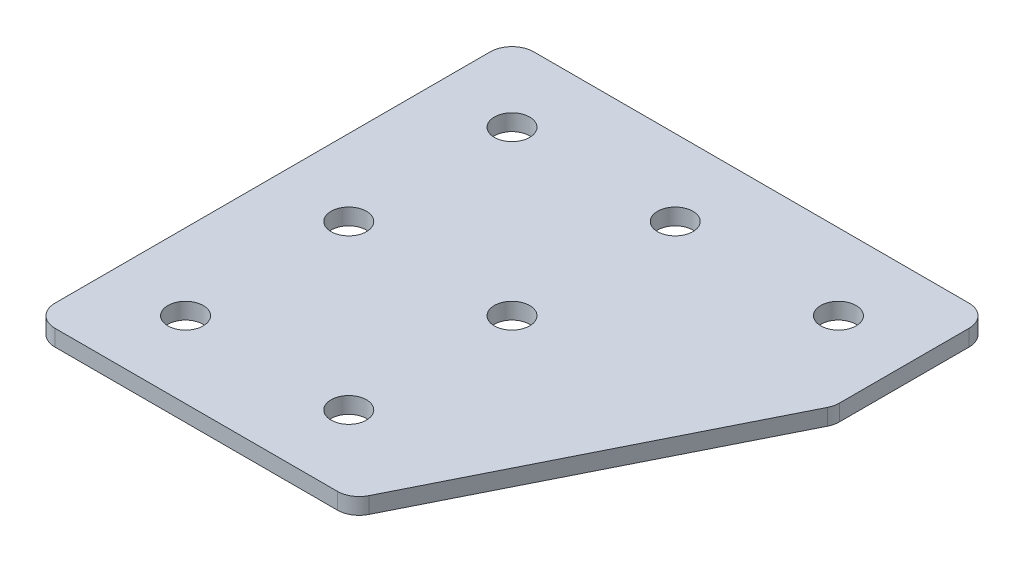
ISO-10303-21;
HEADER;
FILE_DESCRIPTION(('STEP AP214'),'2;1');
FILE_NAME('part.step','',(''),(''),'','','');
FILE_SCHEMA(('AUTOMOTIVE_DESIGN { 1 0 10303 214 1 1 1 1 }'));
ENDSEC;
DATA;
#1=APPLICATION_CONTEXT('core data for automotive mechanical design processes');
#2=APPLICATION_PROTOCOL_DEFINITION('international standard','automotive_design',2000,#1);
#3=PRODUCT_CONTEXT('',#1,'mechanical');
#4=PRODUCT('Part','Part','',(#3));
#5=PRODUCT_RELATED_PRODUCT_CATEGORY('part','',(#4));
#6=PRODUCT_DEFINITION_FORMATION('','',#4);
#7=PRODUCT_DEFINITION_CONTEXT('part definition',#1,'design');
#8=PRODUCT_DEFINITION('design','',#6,#7);
#9=PRODUCT_DEFINITION_SHAPE('','',#8);
#10=(LENGTH_UNIT() NAMED_UNIT(*) SI_UNIT(.MILLI.,.METRE.));
#11=(NAMED_UNIT(*) PLANE_ANGLE_UNIT() SI_UNIT($,.RADIAN.));
#12=(NAMED_UNIT(*) SI_UNIT($,.STERADIAN.) SOLID_ANGLE_UNIT());
#13=UNCERTAINTY_MEASURE_WITH_UNIT(LENGTH_MEASURE(1.E-05),#10,'distance_accuracy_value','');
#14=(GEOMETRIC_REPRESENTATION_CONTEXT(3) GLOBAL_UNCERTAINTY_ASSIGNED_CONTEXT((#13)) GLOBAL_UNIT_ASSIGNED_CONTEXT((#10,
#11,#12)) REPRESENTATION_CONTEXT('',''));
#15=CARTESIAN_POINT('',(0.,0.,0.));
#16=DIRECTION('',(0.,0.,1.));
#17=DIRECTION('',(1.,0.,0.));
#18=AXIS2_PLACEMENT_3D('',#15,#16,#17);
#19=CARTESIAN_POINT('',(-9.06181460766891,2.17462627726309,-16.3623363744272));
#20=DIRECTION('',(0.,-1.,0.));
#21=DIRECTION('',(0.,0.,-1.));
#22=AXIS2_PLACEMENT_3D('',#19,#20,#21);
#23=PLANE('',#22);
#24=CARTESIAN_POINT('',(-1.5618146076689,2.17462627726309,13.6376636255728));
#25=DIRECTION('',(0.,1.,0.));
#26=DIRECTION('',(0.,0.,1.));
#27=AXIS2_PLACEMENT_3D('',#24,#25,#26);
#28=CIRCLE('',#27,1.625);
#29=CARTESIAN_POINT('',(-1.5618146076689,2.17462627726309,15.2626636255728));
#30=VERTEX_POINT('',#29);
#31=EDGE_CURVE('E257',#30,#30,#28,.T.);
#32=ORIENTED_EDGE('',*,*,#31,.T.);
#33=EDGE_LOOP('',(#32));
#34=FACE_BOUND('',#33,.T.);
#35=CARTESIAN_POINT('',(-16.5618146076689,2.17462627726309,13.6376636255728));
#36=DIRECTION('',(0.,1.,0.));
#37=DIRECTION('',(0.,0.,1.));
#38=AXIS2_PLACEMENT_3D('',#35,#36,#37);
#39=CIRCLE('',#38,1.625);
#40=CARTESIAN_POINT('',(-16.5618146076689,2.17462627726309,15.2626636255728));
#41=VERTEX_POINT('',#40);
#42=EDGE_CURVE('E265',#41,#41,#39,.T.);
#43=ORIENTED_EDGE('',*,*,#42,.T.);
#44=EDGE_LOOP('',(#43));
#45=FACE_BOUND('',#44,.T.);
#46=CARTESIAN_POINT('',(-1.5618146076689,2.17462627726309,-1.36233637442725));
#47=DIRECTION('',(0.,1.,0.));
#48=DIRECTION('',(0.,0.,1.));
#49=AXIS2_PLACEMENT_3D('',#46,#47,#48);
#50=CIRCLE('',#49,1.625);
#51=CARTESIAN_POINT('',(-1.5618146076689,2.17462627726309,0.262663625572754));
#52=VERTEX_POINT('',#51);
#53=EDGE_CURVE('E271',#52,#52,#50,.T.);
#54=ORIENTED_EDGE('',*,*,#53,.T.);
#55=EDGE_LOOP('',(#54));
#56=FACE_BOUND('',#55,.T.);
#57=CARTESIAN_POINT('',(-16.5618146076689,2.17462627726309,-1.36233637442725));
#58=DIRECTION('',(0.,1.,0.));
#59=DIRECTION('',(0.,0.,1.));
#60=AXIS2_PLACEMENT_3D('',#57,#58,#59);
#61=CIRCLE('',#60,1.625);
#62=CARTESIAN_POINT('',(-16.5618146076689,2.17462627726309,0.262663625572754));
#63=VERTEX_POINT('',#62);
#64=EDGE_CURVE('E277',#63,#63,#61,.T.);
#65=ORIENTED_EDGE('',*,*,#64,.T.);
#66=EDGE_LOOP('',(#65));
#67=FACE_BOUND('',#66,.T.);
#68=CARTESIAN_POINT('',(13.4381853923311,2.17462627726309,-16.3623363744272));
#69=DIRECTION('',(0.,1.,0.));
#70=DIRECTION('',(0.,0.,1.));
#71=AXIS2_PLACEMENT_3D('',#68,#69,#70);
#72=CIRCLE('',#71,1.625);
#73=CARTESIAN_POINT('',(13.4381853923311,2.17462627726309,-14.7373363744272));
#74=VERTEX_POINT('',#73);
#75=EDGE_CURVE('E283',#74,#74,#72,.T.);
#76=ORIENTED_EDGE('',*,*,#75,.T.);
#77=EDGE_LOOP('',(#76));
#78=FACE_BOUND('',#77,.T.);
#79=CARTESIAN_POINT('',(-1.5618146076689,2.17462627726309,-16.3623363744272));
#80=DIRECTION('',(0.,1.,0.));
#81=DIRECTION('',(0.,0.,1.));
#82=AXIS2_PLACEMENT_3D('',#79,#80,#81);
#83=CIRCLE('',#82,1.625);
#84=CARTESIAN_POINT('',(-1.5618146076689,2.17462627726309,-14.7373363744272));
#85=VERTEX_POINT('',#84);
#86=EDGE_CURVE('E289',#85,#85,#83,.T.);
#87=ORIENTED_EDGE('',*,*,#86,.T.);
#88=EDGE_LOOP('',(#87));
#89=FACE_BOUND('',#88,.T.);
#90=CARTESIAN_POINT('',(-16.5618146076689,2.17462627726309,-16.3623363744272));
#91=DIRECTION('',(0.,1.,0.));
#92=DIRECTION('',(0.,0.,1.));
#93=AXIS2_PLACEMENT_3D('',#90,#91,#92);
#94=CIRCLE('',#93,1.625);
#95=CARTESIAN_POINT('',(-16.5618146076689,2.17462627726309,-14.7373363744272));
#96=VERTEX_POINT('',#95);
#97=EDGE_CURVE('E176',#96,#96,#94,.T.);
#98=ORIENTED_EDGE('',*,*,#97,.T.);
#99=EDGE_LOOP('',(#98));
#100=FACE_BOUND('',#99,.T.);
#101=DIRECTION('',(1.,0.,0.));
#102=VECTOR('',#101,1.);
#103=CARTESIAN_POINT('',(-23.561814607669,2.17462627726309,20.6376636255727));
#104=LINE('',#103,#102);
#105=CARTESIAN_POINT('',(-21.561814607669,2.17462627726309,20.6376636255727));
#106=VERTEX_POINT('',#105);
#107=CARTESIAN_POINT('',(4.39310042045646,2.17462627726309,20.6376636255727));
#108=VERTEX_POINT('',#107);
#109=EDGE_CURVE('E165',#106,#108,#104,.T.);
#110=ORIENTED_EDGE('',*,*,#109,.F.);
#111=CARTESIAN_POINT('',(-21.561814607669,2.17462627726309,18.6376636255727));
#112=DIRECTION('',(0.,-1.,0.));
#113=DIRECTION('',(0.,0.,-1.));
#114=AXIS2_PLACEMENT_3D('',#111,#112,#113);
#115=CIRCLE('',#114,2.);
#116=CARTESIAN_POINT('',(-23.561814607669,2.17462627726309,18.6376636255727));
#117=VERTEX_POINT('',#116);
#118=EDGE_CURVE('E146',#106,#117,#115,.T.);
#119=ORIENTED_EDGE('',*,*,#118,.T.);
#120=DIRECTION('',(0.,0.,1.));
#121=VECTOR('',#120,1.);
#122=CARTESIAN_POINT('',(-23.561814607669,2.17462627726309,-23.3623363744273));
#123=LINE('',#122,#121);
#124=CARTESIAN_POINT('',(-23.561814607669,2.17462627726309,-21.3623363744273));
#125=VERTEX_POINT('',#124);
#126=EDGE_CURVE('E163',#125,#117,#123,.T.);
#127=ORIENTED_EDGE('',*,*,#126,.F.);
#128=CARTESIAN_POINT('',(-21.561814607669,2.17462627726309,-21.3623363744273));
#129=DIRECTION('',(0.,-1.,0.));
#130=DIRECTION('',(0.,0.,-1.));
#131=AXIS2_PLACEMENT_3D('',#128,#129,#130);
#132=CIRCLE('',#131,2.);
#133=CARTESIAN_POINT('',(-21.561814607669,2.17462627726309,-23.3623363744273));
#134=VERTEX_POINT('',#133);
#135=EDGE_CURVE('E117',#125,#134,#132,.T.);
#136=ORIENTED_EDGE('',*,*,#135,.T.);
#137=DIRECTION('',(-1.,0.,0.));
#138=VECTOR('',#137,1.);
#139=CARTESIAN_POINT('',(20.438185392331,2.17462627726309,-23.3623363744273));
#140=LINE('',#139,#138);
#141=CARTESIAN_POINT('',(18.438185392331,2.17462627726309,-23.3623363744273));
#142=VERTEX_POINT('',#141);
#143=EDGE_CURVE('E161',#142,#134,#140,.T.);
#144=ORIENTED_EDGE('',*,*,#143,.F.);
#145=CARTESIAN_POINT('',(18.438185392331,2.17462627726309,-21.3623363744273));
#146=DIRECTION('',(0.,-1.,0.));
#147=DIRECTION('',(0.,0.,-1.));
#148=AXIS2_PLACEMENT_3D('',#145,#146,#147);
#149=CIRCLE('',#148,2.);
#150=CARTESIAN_POINT('',(20.438185392331,2.17462627726309,-21.3623363744273));
#151=VERTEX_POINT('',#150);
#152=EDGE_CURVE('E141',#142,#151,#149,.T.);
#153=ORIENTED_EDGE('',*,*,#152,.T.);
#154=DIRECTION('',(0.,0.,-1.));
#155=VECTOR('',#154,1.);
#156=CARTESIAN_POINT('',(20.438185392331,2.17462627726309,-8.98037036317711));
#157=LINE('',#156,#155);
#158=CARTESIAN_POINT('',(20.438185392331,2.17462627726309,-9.45250631817667));
#159=VERTEX_POINT('',#158);
#160=EDGE_CURVE('E118',#159,#151,#157,.T.);
#161=ORIENTED_EDGE('',*,*,#160,.F.);
#162=CARTESIAN_POINT('',(18.438185392331,2.17462627726309,-9.45250631817667));
#163=DIRECTION('',(0.,-1.,0.));
#164=DIRECTION('',(0.,0.,-1.));
#165=AXIS2_PLACEMENT_3D('',#162,#163,#164);
#166=CIRCLE('',#165,2.);
#167=CARTESIAN_POINT('',(20.2270397743308,2.17462627726309,-8.55807912717676));
#168=VERTEX_POINT('',#167);
#169=EDGE_CURVE('E31',#159,#168,#166,.T.);
#170=ORIENTED_EDGE('',*,*,#169,.T.);
#171=DIRECTION('',(0.447213595499954,0.,-0.894427190999918));
#172=VECTOR('',#171,1.);
#173=CARTESIAN_POINT('',(5.62916839795626,2.17462627726309,20.6376636255727));
#174=LINE('',#173,#172);
#175=CARTESIAN_POINT('',(6.1819548024563,2.17462627726309,19.5320908165726));
#176=VERTEX_POINT('',#175);
#177=EDGE_CURVE('E122',#176,#168,#174,.T.);
#178=ORIENTED_EDGE('',*,*,#177,.F.);
#179=CARTESIAN_POINT('',(4.39310042045646,2.17462627726309,18.6376636255727));
#180=DIRECTION('',(0.,-1.,0.));
#181=DIRECTION('',(0.,0.,-1.));
#182=AXIS2_PLACEMENT_3D('',#179,#180,#181);
#183=CIRCLE('',#182,2.);
#184=EDGE_CURVE('E144',#176,#108,#183,.T.);
#185=ORIENTED_EDGE('',*,*,#184,.T.);
#186=EDGE_LOOP('',(#110,#119,#127,#136,#144,#153,#161,#170,#178,#185));
#187=FACE_BOUND('',#186,.T.);
#188=ADVANCED_FACE('F16',(#34,#45,#56,#67,#78,#89,#100,#187),#23,.T.);
#189=CARTESIAN_POINT('',(20.438185392331,2.17462627726309,-23.3623363744273));
#190=DIRECTION('',(0.,0.,-1.));
#191=DIRECTION('',(-1.,0.,0.));
#192=AXIS2_PLACEMENT_3D('',#189,#190,#191);
#193=PLANE('',#192);
#194=DIRECTION('',(-1.,0.,0.));
#195=VECTOR('',#194,1.);
#196=CARTESIAN_POINT('',(20.438185392331,3.67462627726309,-23.3623363744273));
#197=LINE('',#196,#195);
#198=CARTESIAN_POINT('',(18.438185392331,3.67462627726309,-23.3623363744273));
#199=VERTEX_POINT('',#198);
#200=CARTESIAN_POINT('',(-21.561814607669,3.67462627726309,-23.3623363744273));
#201=VERTEX_POINT('',#200);
#202=EDGE_CURVE('E99',#199,#201,#197,.T.);
#203=ORIENTED_EDGE('',*,*,#202,.F.);
#204=DIRECTION('',(0.,1.,0.));
#205=VECTOR('',#204,1.);
#206=CARTESIAN_POINT('',(18.438185392331,2.17462627726309,-23.3623363744273));
#207=LINE('',#206,#205);
#208=EDGE_CURVE('E10',#199,#142,#207,.F.);
#209=ORIENTED_EDGE('',*,*,#208,.T.);
#210=ORIENTED_EDGE('',*,*,#143,.T.);
#211=DIRECTION('',(0.,1.,0.));
#212=VECTOR('',#211,1.);
#213=CARTESIAN_POINT('',(-21.561814607669,2.17462627726309,-23.3623363744273));
#214=LINE('',#213,#212);
#215=EDGE_CURVE('E24',#134,#201,#214,.T.);
#216=ORIENTED_EDGE('',*,*,#215,.T.);
#217=EDGE_LOOP('',(#203,#209,#210,#216));
#218=FACE_BOUND('',#217,.T.);
#219=ADVANCED_FACE('F158',(#218),#193,.T.);
#220=CARTESIAN_POINT('',(20.438185392331,2.17462627726309,-8.98037036317711));
#221=DIRECTION('',(1.,0.,0.));
#222=DIRECTION('',(0.,0.,-1.));
#223=AXIS2_PLACEMENT_3D('',#220,#221,#222);
#224=PLANE('',#223);
#225=DIRECTION('',(0.,0.,-1.));
#226=VECTOR('',#225,1.);
#227=CARTESIAN_POINT('',(20.438185392331,3.67462627726309,-8.98037036317711));
#228=LINE('',#227,#226);
#229=CARTESIAN_POINT('',(20.438185392331,3.67462627726309,-9.45250631817667));
#230=VERTEX_POINT('',#229);
#231=CARTESIAN_POINT('',(20.438185392331,3.67462627726309,-21.3623363744273));
#232=VERTEX_POINT('',#231);
#233=EDGE_CURVE('E125',#230,#232,#228,.T.);
#234=ORIENTED_EDGE('',*,*,#233,.F.);
#235=DIRECTION('',(0.,1.,0.));
#236=VECTOR('',#235,1.);
#237=CARTESIAN_POINT('',(20.438185392331,2.17462627726309,-9.45250631817667));
#238=LINE('',#237,#236);
#239=EDGE_CURVE('E155',#230,#159,#238,.F.);
#240=ORIENTED_EDGE('',*,*,#239,.T.);
#241=ORIENTED_EDGE('',*,*,#160,.T.);
#242=DIRECTION('',(0.,1.,0.));
#243=VECTOR('',#242,1.);
#244=CARTESIAN_POINT('',(20.438185392331,2.17462627726309,-21.3623363744273));
#245=LINE('',#244,#243);
#246=EDGE_CURVE('E152',#151,#232,#245,.T.);
#247=ORIENTED_EDGE('',*,*,#246,.T.);
#248=EDGE_LOOP('',(#234,#240,#241,#247));
#249=FACE_BOUND('',#248,.T.);
#250=ADVANCED_FACE('F212',(#249),#224,.T.);
#251=CARTESIAN_POINT('',(5.62916839795626,2.17462627726309,20.6376636255727));
#252=DIRECTION('',(0.894427190999918,0.,0.447213595499953));
#253=DIRECTION('',(0.447213595499954,0.,-0.894427190999918));
#254=AXIS2_PLACEMENT_3D('',#251,#252,#253);
#255=PLANE('',#254);
#256=DIRECTION('',(0.447213595499954,0.,-0.894427190999918));
#257=VECTOR('',#256,1.);
#258=CARTESIAN_POINT('',(5.62916839795626,3.67462627726309,20.6376636255727));
#259=LINE('',#258,#257);
#260=CARTESIAN_POINT('',(6.1819548024563,3.67462627726309,19.5320908165726));
#261=VERTEX_POINT('',#260);
#262=CARTESIAN_POINT('',(20.2270397743308,3.67462627726309,-8.55807912717676));
#263=VERTEX_POINT('',#262);
#264=EDGE_CURVE('E168',#261,#263,#259,.T.);
#265=ORIENTED_EDGE('',*,*,#264,.F.);
#266=DIRECTION('',(0.,1.,0.));
#267=VECTOR('',#266,1.);
#268=CARTESIAN_POINT('',(6.1819548024563,2.17462627726309,19.5320908165726));
#269=LINE('',#268,#267);
#270=EDGE_CURVE('E38',#261,#176,#269,.F.);
#271=ORIENTED_EDGE('',*,*,#270,.T.);
#272=ORIENTED_EDGE('',*,*,#177,.T.);
#273=DIRECTION('',(0.,1.,0.));
#274=VECTOR('',#273,1.);
#275=CARTESIAN_POINT('',(20.2270397743308,2.17462627726309,-8.55807912717676));
#276=LINE('',#275,#274);
#277=EDGE_CURVE('E148',#168,#263,#276,.T.);
#278=ORIENTED_EDGE('',*,*,#277,.T.);
#279=EDGE_LOOP('',(#265,#271,#272,#278));
#280=FACE_BOUND('',#279,.T.);
#281=ADVANCED_FACE('F181',(#280),#255,.T.);
#282=CARTESIAN_POINT('',(-23.561814607669,2.17462627726309,20.6376636255727));
#283=DIRECTION('',(0.,0.,1.));
#284=DIRECTION('',(1.,0.,0.));
#285=AXIS2_PLACEMENT_3D('',#282,#283,#284);
#286=PLANE('',#285);
#287=DIRECTION('',(1.,0.,0.));
#288=VECTOR('',#287,1.);
#289=CARTESIAN_POINT('',(-23.561814607669,3.67462627726309,20.6376636255727));
#290=LINE('',#289,#288);
#291=CARTESIAN_POINT('',(-21.561814607669,3.67462627726309,20.6376636255727));
#292=VERTEX_POINT('',#291);
#293=CARTESIAN_POINT('',(4.39310042045646,3.67462627726309,20.6376636255727));
#294=VERTEX_POINT('',#293);
#295=EDGE_CURVE('E114',#292,#294,#290,.T.);
#296=ORIENTED_EDGE('',*,*,#295,.F.);
#297=DIRECTION('',(0.,1.,0.));
#298=VECTOR('',#297,1.);
#299=CARTESIAN_POINT('',(-21.561814607669,2.17462627726309,20.6376636255727));
#300=LINE('',#299,#298);
#301=EDGE_CURVE('E138',#292,#106,#300,.F.);
#302=ORIENTED_EDGE('',*,*,#301,.T.);
#303=ORIENTED_EDGE('',*,*,#109,.T.);
#304=DIRECTION('',(0.,1.,0.));
#305=VECTOR('',#304,1.);
#306=CARTESIAN_POINT('',(4.39310042045646,2.17462627726309,20.6376636255727));
#307=LINE('',#306,#305);
#308=EDGE_CURVE('E135',#108,#294,#307,.T.);
#309=ORIENTED_EDGE('',*,*,#308,.T.);
#310=EDGE_LOOP('',(#296,#302,#303,#309));
#311=FACE_BOUND('',#310,.T.);
#312=ADVANCED_FACE('F191',(#311),#286,.T.);
#313=CARTESIAN_POINT('',(-23.561814607669,2.17462627726309,-23.3623363744273));
#314=DIRECTION('',(-1.,0.,0.));
#315=DIRECTION('',(0.,0.,1.));
#316=AXIS2_PLACEMENT_3D('',#313,#314,#315);
#317=PLANE('',#316);
#318=ORIENTED_EDGE('',*,*,#126,.T.);
#319=DIRECTION('',(0.,1.,0.));
#320=VECTOR('',#319,1.);
#321=CARTESIAN_POINT('',(-23.561814607669,2.17462627726309,18.6376636255727));
#322=LINE('',#321,#320);
#323=CARTESIAN_POINT('',(-23.561814607669,3.67462627726309,18.6376636255727));
#324=VERTEX_POINT('',#323);
#325=EDGE_CURVE('E105',#117,#324,#322,.T.);
#326=ORIENTED_EDGE('',*,*,#325,.T.);
#327=DIRECTION('',(0.,0.,1.));
#328=VECTOR('',#327,1.);
#329=CARTESIAN_POINT('',(-23.561814607669,3.67462627726309,-23.3623363744273));
#330=LINE('',#329,#328);
#331=CARTESIAN_POINT('',(-23.561814607669,3.67462627726309,-21.3623363744273));
#332=VERTEX_POINT('',#331);
#333=EDGE_CURVE('E97',#332,#324,#330,.T.);
#334=ORIENTED_EDGE('',*,*,#333,.F.);
#335=DIRECTION('',(0.,1.,0.));
#336=VECTOR('',#335,1.);
#337=CARTESIAN_POINT('',(-23.561814607669,2.17462627726309,-21.3623363744273));
#338=LINE('',#337,#336);
#339=EDGE_CURVE('E111',#332,#125,#338,.F.);
#340=ORIENTED_EDGE('',*,*,#339,.T.);
#341=EDGE_LOOP('',(#318,#326,#334,#340));
#342=FACE_BOUND('',#341,.T.);
#343=ADVANCED_FACE('F110',(#342),#317,.T.);
#344=CARTESIAN_POINT('',(-9.06181460766891,3.67462627726309,-16.3623363744272));
#345=DIRECTION('',(0.,-1.,0.));
#346=DIRECTION('',(0.,0.,-1.));
#347=AXIS2_PLACEMENT_3D('',#344,#345,#346);
#348=PLANE('',#347);
#349=CARTESIAN_POINT('',(-1.5618146076689,3.67462627726309,13.6376636255728));
#350=DIRECTION('',(0.,1.,0.));
#351=DIRECTION('',(0.,0.,1.));
#352=AXIS2_PLACEMENT_3D('',#349,#350,#351);
#353=CIRCLE('',#352,1.625);
#354=CARTESIAN_POINT('',(-1.5618146076689,3.67462627726309,15.2626636255728));
#355=VERTEX_POINT('',#354);
#356=EDGE_CURVE('E260',#355,#355,#353,.T.);
#357=ORIENTED_EDGE('',*,*,#356,.F.);
#358=EDGE_LOOP('',(#357));
#359=FACE_BOUND('',#358,.T.);
#360=CARTESIAN_POINT('',(-16.5618146076689,3.67462627726309,13.6376636255728));
#361=DIRECTION('',(0.,1.,0.));
#362=DIRECTION('',(0.,0.,1.));
#363=AXIS2_PLACEMENT_3D('',#360,#361,#362);
#364=CIRCLE('',#363,1.625);
#365=CARTESIAN_POINT('',(-16.5618146076689,3.67462627726309,15.2626636255728));
#366=VERTEX_POINT('',#365);
#367=EDGE_CURVE('E262',#366,#366,#364,.T.);
#368=ORIENTED_EDGE('',*,*,#367,.F.);
#369=EDGE_LOOP('',(#368));
#370=FACE_BOUND('',#369,.T.);
#371=CARTESIAN_POINT('',(-1.5618146076689,3.67462627726309,-1.36233637442725));
#372=DIRECTION('',(0.,1.,0.));
#373=DIRECTION('',(0.,0.,1.));
#374=AXIS2_PLACEMENT_3D('',#371,#372,#373);
#375=CIRCLE('',#374,1.625);
#376=CARTESIAN_POINT('',(-1.5618146076689,3.67462627726309,0.262663625572754));
#377=VERTEX_POINT('',#376);
#378=EDGE_CURVE('E268',#377,#377,#375,.T.);
#379=ORIENTED_EDGE('',*,*,#378,.F.);
#380=EDGE_LOOP('',(#379));
#381=FACE_BOUND('',#380,.T.);
#382=CARTESIAN_POINT('',(-16.5618146076689,3.67462627726309,-1.36233637442725));
#383=DIRECTION('',(0.,1.,0.));
#384=DIRECTION('',(0.,0.,1.));
#385=AXIS2_PLACEMENT_3D('',#382,#383,#384);
#386=CIRCLE('',#385,1.625);
#387=CARTESIAN_POINT('',(-16.5618146076689,3.67462627726309,0.262663625572754));
#388=VERTEX_POINT('',#387);
#389=EDGE_CURVE('E274',#388,#388,#386,.T.);
#390=ORIENTED_EDGE('',*,*,#389,.F.);
#391=EDGE_LOOP('',(#390));
#392=FACE_BOUND('',#391,.T.);
#393=CARTESIAN_POINT('',(13.4381853923311,3.67462627726309,-16.3623363744272));
#394=DIRECTION('',(0.,1.,0.));
#395=DIRECTION('',(0.,0.,1.));
#396=AXIS2_PLACEMENT_3D('',#393,#394,#395);
#397=CIRCLE('',#396,1.625);
#398=CARTESIAN_POINT('',(13.4381853923311,3.67462627726309,-14.7373363744272));
#399=VERTEX_POINT('',#398);
#400=EDGE_CURVE('E280',#399,#399,#397,.T.);
#401=ORIENTED_EDGE('',*,*,#400,.F.);
#402=EDGE_LOOP('',(#401));
#403=FACE_BOUND('',#402,.T.);
#404=CARTESIAN_POINT('',(-1.5618146076689,3.67462627726309,-16.3623363744272));
#405=DIRECTION('',(0.,1.,0.));
#406=DIRECTION('',(0.,0.,1.));
#407=AXIS2_PLACEMENT_3D('',#404,#405,#406);
#408=CIRCLE('',#407,1.625);
#409=CARTESIAN_POINT('',(-1.5618146076689,3.67462627726309,-14.7373363744272));
#410=VERTEX_POINT('',#409);
#411=EDGE_CURVE('E286',#410,#410,#408,.T.);
#412=ORIENTED_EDGE('',*,*,#411,.F.);
#413=EDGE_LOOP('',(#412));
#414=FACE_BOUND('',#413,.T.);
#415=CARTESIAN_POINT('',(-16.5618146076689,3.67462627726309,-16.3623363744272));
#416=DIRECTION('',(0.,1.,0.));
#417=DIRECTION('',(0.,0.,1.));
#418=AXIS2_PLACEMENT_3D('',#415,#416,#417);
#419=CIRCLE('',#418,1.625);
#420=CARTESIAN_POINT('',(-16.5618146076689,3.67462627726309,-14.7373363744272));
#421=VERTEX_POINT('',#420);
#422=EDGE_CURVE('E170',#421,#421,#419,.T.);
#423=ORIENTED_EDGE('',*,*,#422,.F.);
#424=EDGE_LOOP('',(#423));
#425=FACE_BOUND('',#424,.T.);
#426=ORIENTED_EDGE('',*,*,#333,.T.);
#427=CARTESIAN_POINT('',(-21.561814607669,3.67462627726309,18.6376636255727));
#428=DIRECTION('',(0.,-1.,0.));
#429=DIRECTION('',(0.,0.,-1.));
#430=AXIS2_PLACEMENT_3D('',#427,#428,#429);
#431=CIRCLE('',#430,2.);
#432=EDGE_CURVE('E133',#324,#292,#431,.F.);
#433=ORIENTED_EDGE('',*,*,#432,.T.);
#434=ORIENTED_EDGE('',*,*,#295,.T.);
#435=CARTESIAN_POINT('',(4.39310042045646,3.67462627726309,18.6376636255727));
#436=DIRECTION('',(0.,-1.,0.));
#437=DIRECTION('',(0.,0.,-1.));
#438=AXIS2_PLACEMENT_3D('',#435,#436,#437);
#439=CIRCLE('',#438,2.);
#440=EDGE_CURVE('E131',#294,#261,#439,.F.);
#441=ORIENTED_EDGE('',*,*,#440,.T.);
#442=ORIENTED_EDGE('',*,*,#264,.T.);
#443=CARTESIAN_POINT('',(18.438185392331,3.67462627726309,-9.45250631817667));
#444=DIRECTION('',(0.,-1.,0.));
#445=DIRECTION('',(0.,0.,-1.));
#446=AXIS2_PLACEMENT_3D('',#443,#444,#445);
#447=CIRCLE('',#446,2.);
#448=EDGE_CURVE('E129',#263,#230,#447,.F.);
#449=ORIENTED_EDGE('',*,*,#448,.T.);
#450=ORIENTED_EDGE('',*,*,#233,.T.);
#451=CARTESIAN_POINT('',(18.438185392331,3.67462627726309,-21.3623363744273));
#452=DIRECTION('',(0.,-1.,0.));
#453=DIRECTION('',(0.,0.,-1.));
#454=AXIS2_PLACEMENT_3D('',#451,#452,#453);
#455=CIRCLE('',#454,2.);
#456=EDGE_CURVE('E104',#232,#199,#455,.F.);
#457=ORIENTED_EDGE('',*,*,#456,.T.);
#458=ORIENTED_EDGE('',*,*,#202,.T.);
#459=CARTESIAN_POINT('',(-21.561814607669,3.67462627726309,-21.3623363744273));
#460=DIRECTION('',(0.,-1.,0.));
#461=DIRECTION('',(0.,0.,-1.));
#462=AXIS2_PLACEMENT_3D('',#459,#460,#461);
#463=CIRCLE('',#462,2.);
#464=EDGE_CURVE('E94',#201,#332,#463,.F.);
#465=ORIENTED_EDGE('',*,*,#464,.T.);
#466=EDGE_LOOP('',(#426,#433,#434,#441,#442,#449,#450,#457,#458,#465));
#467=FACE_BOUND('',#466,.T.);
#468=ADVANCED_FACE('F96',(#359,#370,#381,#392,#403,#414,#425,#467),#348,.F.);
#469=CARTESIAN_POINT('',(-21.561814607669,2.17462627726309,18.6376636255727));
#470=DIRECTION('',(0.,1.,0.));
#471=DIRECTION('',(0.,0.,1.));
#472=AXIS2_PLACEMENT_3D('',#469,#470,#471);
#473=CYLINDRICAL_SURFACE('',#472,2.);
#474=ORIENTED_EDGE('',*,*,#118,.F.);
#475=ORIENTED_EDGE('',*,*,#301,.F.);
#476=ORIENTED_EDGE('',*,*,#432,.F.);
#477=ORIENTED_EDGE('',*,*,#325,.F.);
#478=EDGE_LOOP('',(#474,#475,#476,#477));
#479=FACE_BOUND('',#478,.T.);
#480=ADVANCED_FACE('F194',(#479),#473,.T.);
#481=CARTESIAN_POINT('',(4.39310042045646,2.17462627726309,18.6376636255727));
#482=DIRECTION('',(0.,1.,0.));
#483=DIRECTION('',(0.,0.,1.));
#484=AXIS2_PLACEMENT_3D('',#481,#482,#483);
#485=CYLINDRICAL_SURFACE('',#484,2.);
#486=ORIENTED_EDGE('',*,*,#184,.F.);
#487=ORIENTED_EDGE('',*,*,#270,.F.);
#488=ORIENTED_EDGE('',*,*,#440,.F.);
#489=ORIENTED_EDGE('',*,*,#308,.F.);
#490=EDGE_LOOP('',(#486,#487,#488,#489));
#491=FACE_BOUND('',#490,.T.);
#492=ADVANCED_FACE('F185',(#491),#485,.T.);
#493=CARTESIAN_POINT('',(18.438185392331,2.17462627726309,-9.45250631817667));
#494=DIRECTION('',(0.,1.,0.));
#495=DIRECTION('',(0.,0.,1.));
#496=AXIS2_PLACEMENT_3D('',#493,#494,#495);
#497=CYLINDRICAL_SURFACE('',#496,2.);
#498=ORIENTED_EDGE('',*,*,#169,.F.);
#499=ORIENTED_EDGE('',*,*,#239,.F.);
#500=ORIENTED_EDGE('',*,*,#448,.F.);
#501=ORIENTED_EDGE('',*,*,#277,.F.);
#502=EDGE_LOOP('',(#498,#499,#500,#501));
#503=FACE_BOUND('',#502,.T.);
#504=ADVANCED_FACE('F202',(#503),#497,.T.);
#505=CARTESIAN_POINT('',(18.438185392331,2.17462627726309,-21.3623363744273));
#506=DIRECTION('',(0.,1.,0.));
#507=DIRECTION('',(0.,0.,1.));
#508=AXIS2_PLACEMENT_3D('',#505,#506,#507);
#509=CYLINDRICAL_SURFACE('',#508,2.);
#510=ORIENTED_EDGE('',*,*,#152,.F.);
#511=ORIENTED_EDGE('',*,*,#208,.F.);
#512=ORIENTED_EDGE('',*,*,#456,.F.);
#513=ORIENTED_EDGE('',*,*,#246,.F.);
#514=EDGE_LOOP('',(#510,#511,#512,#513));
#515=FACE_BOUND('',#514,.T.);
#516=ADVANCED_FACE('F356',(#515),#509,.T.);
#517=CARTESIAN_POINT('',(-21.561814607669,2.17462627726309,-21.3623363744273));
#518=DIRECTION('',(0.,1.,0.));
#519=DIRECTION('',(0.,0.,1.));
#520=AXIS2_PLACEMENT_3D('',#517,#518,#519);
#521=CYLINDRICAL_SURFACE('',#520,2.);
#522=ORIENTED_EDGE('',*,*,#135,.F.);
#523=ORIENTED_EDGE('',*,*,#339,.F.);
#524=ORIENTED_EDGE('',*,*,#464,.F.);
#525=ORIENTED_EDGE('',*,*,#215,.F.);
#526=EDGE_LOOP('',(#522,#523,#524,#525));
#527=FACE_BOUND('',#526,.T.);
#528=ADVANCED_FACE('F18',(#527),#521,.T.);
#529=CARTESIAN_POINT('',(-16.5618146076689,2.17462627726309,-16.3623363744272));
#530=DIRECTION('',(0.,1.,0.));
#531=DIRECTION('',(0.,0.,1.));
#532=AXIS2_PLACEMENT_3D('',#529,#530,#531);
#533=CYLINDRICAL_SURFACE('',#532,1.625);
#534=ORIENTED_EDGE('',*,*,#97,.F.);
#535=EDGE_LOOP('',(#534));
#536=FACE_BOUND('',#535,.T.);
#537=ORIENTED_EDGE('',*,*,#422,.T.);
#538=EDGE_LOOP('',(#537));
#539=FACE_BOUND('',#538,.T.);
#540=ADVANCED_FACE('F226',(#536,#539),#533,.F.);
#541=CARTESIAN_POINT('',(-1.5618146076689,2.17462627726309,-16.3623363744272));
#542=DIRECTION('',(0.,1.,0.));
#543=DIRECTION('',(0.,0.,1.));
#544=AXIS2_PLACEMENT_3D('',#541,#542,#543);
#545=CYLINDRICAL_SURFACE('',#544,1.625);
#546=ORIENTED_EDGE('',*,*,#86,.F.);
#547=EDGE_LOOP('',(#546));
#548=FACE_BOUND('',#547,.T.);
#549=ORIENTED_EDGE('',*,*,#411,.T.);
#550=EDGE_LOOP('',(#549));
#551=FACE_BOUND('',#550,.T.);
#552=ADVANCED_FACE('F229',(#548,#551),#545,.F.);
#553=CARTESIAN_POINT('',(13.4381853923311,2.17462627726309,-16.3623363744272));
#554=DIRECTION('',(0.,1.,0.));
#555=DIRECTION('',(0.,0.,1.));
#556=AXIS2_PLACEMENT_3D('',#553,#554,#555);
#557=CYLINDRICAL_SURFACE('',#556,1.625);
#558=ORIENTED_EDGE('',*,*,#75,.F.);
#559=EDGE_LOOP('',(#558));
#560=FACE_BOUND('',#559,.T.);
#561=ORIENTED_EDGE('',*,*,#400,.T.);
#562=EDGE_LOOP('',(#561));
#563=FACE_BOUND('',#562,.T.);
#564=ADVANCED_FACE('F233',(#560,#563),#557,.F.);
#565=CARTESIAN_POINT('',(-16.5618146076689,2.17462627726309,-1.36233637442725));
#566=DIRECTION('',(0.,1.,0.));
#567=DIRECTION('',(0.,0.,1.));
#568=AXIS2_PLACEMENT_3D('',#565,#566,#567);
#569=CYLINDRICAL_SURFACE('',#568,1.625);
#570=ORIENTED_EDGE('',*,*,#64,.F.);
#571=EDGE_LOOP('',(#570));
#572=FACE_BOUND('',#571,.T.);
#573=ORIENTED_EDGE('',*,*,#389,.T.);
#574=EDGE_LOOP('',(#573));
#575=FACE_BOUND('',#574,.T.);
#576=ADVANCED_FACE('F237',(#572,#575),#569,.F.);
#577=CARTESIAN_POINT('',(-1.5618146076689,2.17462627726309,-1.36233637442725));
#578=DIRECTION('',(0.,1.,0.));
#579=DIRECTION('',(0.,0.,1.));
#580=AXIS2_PLACEMENT_3D('',#577,#578,#579);
#581=CYLINDRICAL_SURFACE('',#580,1.625);
#582=ORIENTED_EDGE('',*,*,#53,.F.);
#583=EDGE_LOOP('',(#582));
#584=FACE_BOUND('',#583,.T.);
#585=ORIENTED_EDGE('',*,*,#378,.T.);
#586=EDGE_LOOP('',(#585));
#587=FACE_BOUND('',#586,.T.);
#588=ADVANCED_FACE('F241',(#584,#587),#581,.F.);
#589=CARTESIAN_POINT('',(-16.5618146076689,2.17462627726309,13.6376636255728));
#590=DIRECTION('',(0.,1.,0.));
#591=DIRECTION('',(0.,0.,1.));
#592=AXIS2_PLACEMENT_3D('',#589,#590,#591);
#593=CYLINDRICAL_SURFACE('',#592,1.625);
#594=ORIENTED_EDGE('',*,*,#42,.F.);
#595=EDGE_LOOP('',(#594));
#596=FACE_BOUND('',#595,.T.);
#597=ORIENTED_EDGE('',*,*,#367,.T.);
#598=EDGE_LOOP('',(#597));
#599=FACE_BOUND('',#598,.T.);
#600=ADVANCED_FACE('F245',(#596,#599),#593,.F.);
#601=CARTESIAN_POINT('',(-1.5618146076689,2.17462627726309,13.6376636255728));
#602=DIRECTION('',(0.,1.,0.));
#603=DIRECTION('',(0.,0.,1.));
#604=AXIS2_PLACEMENT_3D('',#601,#602,#603);
#605=CYLINDRICAL_SURFACE('',#604,1.625);
#606=ORIENTED_EDGE('',*,*,#31,.F.);
#607=EDGE_LOOP('',(#606));
#608=FACE_BOUND('',#607,.T.);
#609=ORIENTED_EDGE('',*,*,#356,.T.);
#610=EDGE_LOOP('',(#609));
#611=FACE_BOUND('',#610,.T.);
#612=ADVANCED_FACE('F249',(#608,#611),#605,.F.);
#613=CLOSED_SHELL('',(#188,#219,#250,#281,#312,#343,#468,#480,#492,#504,#516,#528,#540,#552,
#564,#576,#588,#600,#612));
#614=MANIFOLD_SOLID_BREP('B1',#613);
#615=ADVANCED_BREP_SHAPE_REPRESENTATION('',(#18,#614),#14);
#616=SHAPE_DEFINITION_REPRESENTATION(#9,#615);
ENDSEC;
END-ISO-10303-21;
